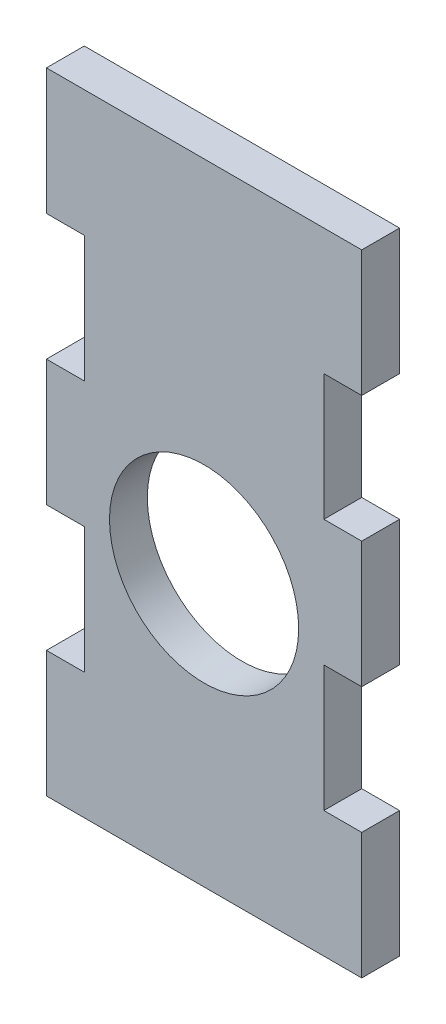
ISO-10303-21;
HEADER;
FILE_DESCRIPTION(('STEP AP214'),'2;1');
FILE_NAME('part.step','',(''),(''),'','','');
FILE_SCHEMA(('AUTOMOTIVE_DESIGN { 1 0 10303 214 1 1 1 1 }'));
ENDSEC;
DATA;
#1=APPLICATION_CONTEXT('core data for automotive mechanical design processes');
#2=APPLICATION_PROTOCOL_DEFINITION('international standard','automotive_design',2000,#1);
#3=PRODUCT_CONTEXT('',#1,'mechanical');
#4=PRODUCT('Part','Part','',(#3));
#5=PRODUCT_RELATED_PRODUCT_CATEGORY('part','',(#4));
#6=PRODUCT_DEFINITION_FORMATION('','',#4);
#7=PRODUCT_DEFINITION_CONTEXT('part definition',#1,'design');
#8=PRODUCT_DEFINITION('design','',#6,#7);
#9=PRODUCT_DEFINITION_SHAPE('','',#8);
#10=(LENGTH_UNIT() NAMED_UNIT(*) SI_UNIT(.MILLI.,.METRE.));
#11=(NAMED_UNIT(*) PLANE_ANGLE_UNIT() SI_UNIT($,.RADIAN.));
#12=(NAMED_UNIT(*) SI_UNIT($,.STERADIAN.) SOLID_ANGLE_UNIT());
#13=UNCERTAINTY_MEASURE_WITH_UNIT(LENGTH_MEASURE(1.E-05),#10,'distance_accuracy_value','');
#14=(GEOMETRIC_REPRESENTATION_CONTEXT(3) GLOBAL_UNCERTAINTY_ASSIGNED_CONTEXT((#13)) GLOBAL_UNIT_ASSIGNED_CONTEXT((#10,
#11,#12)) REPRESENTATION_CONTEXT('',''));
#15=CARTESIAN_POINT('',(0.,0.,0.));
#16=DIRECTION('',(0.,0.,1.));
#17=DIRECTION('',(1.,0.,0.));
#18=AXIS2_PLACEMENT_3D('',#15,#16,#17);
#19=CARTESIAN_POINT('',(-12.5,-25.,3.));
#20=DIRECTION('',(1.,0.,0.));
#21=DIRECTION('',(0.,0.,-1.));
#22=AXIS2_PLACEMENT_3D('',#19,#20,#21);
#23=PLANE('',#22);
#24=DIRECTION('',(0.,-1.,0.));
#25=VECTOR('',#24,1.);
#26=CARTESIAN_POINT('',(-12.5,-25.,0.));
#27=LINE('',#26,#25);
#28=CARTESIAN_POINT('',(-12.5,25.,0.));
#29=VERTEX_POINT('',#28);
#30=CARTESIAN_POINT('',(-12.5,15.,0.));
#31=VERTEX_POINT('',#30);
#32=EDGE_CURVE('E186',#29,#31,#27,.T.);
#33=ORIENTED_EDGE('',*,*,#32,.T.);
#34=DIRECTION('',(0.,0.,1.));
#35=VECTOR('',#34,1.);
#36=CARTESIAN_POINT('',(-12.5,15.,0.));
#37=LINE('',#36,#35);
#38=CARTESIAN_POINT('',(-12.5,15.,3.));
#39=VERTEX_POINT('',#38);
#40=EDGE_CURVE('E170',#31,#39,#37,.T.);
#41=ORIENTED_EDGE('',*,*,#40,.T.);
#42=DIRECTION('',(0.,-1.,0.));
#43=VECTOR('',#42,1.);
#44=CARTESIAN_POINT('',(-12.5,-25.,3.));
#45=LINE('',#44,#43);
#46=CARTESIAN_POINT('',(-12.5,25.,3.));
#47=VERTEX_POINT('',#46);
#48=EDGE_CURVE('E223',#47,#39,#45,.T.);
#49=ORIENTED_EDGE('',*,*,#48,.F.);
#50=DIRECTION('',(0.,0.,-1.));
#51=VECTOR('',#50,1.);
#52=CARTESIAN_POINT('',(-12.5,25.,3.));
#53=LINE('',#52,#51);
#54=EDGE_CURVE('E193',#47,#29,#53,.T.);
#55=ORIENTED_EDGE('',*,*,#54,.T.);
#56=EDGE_LOOP('',(#33,#41,#49,#55));
#57=FACE_BOUND('',#56,.T.);
#58=ADVANCED_FACE('F33',(#57),#23,.F.);
#59=CARTESIAN_POINT('',(-12.5,5.,3.));
#60=VERTEX_POINT('',#59);
#61=CARTESIAN_POINT('',(-12.5,-5.,3.));
#62=VERTEX_POINT('',#61);
#63=EDGE_CURVE('E226',#60,#62,#45,.T.);
#64=ORIENTED_EDGE('',*,*,#63,.F.);
#65=DIRECTION('',(0.,0.,1.));
#66=VECTOR('',#65,1.);
#67=CARTESIAN_POINT('',(-12.5,5.,0.));
#68=LINE('',#67,#66);
#69=CARTESIAN_POINT('',(-12.5,5.,0.));
#70=VERTEX_POINT('',#69);
#71=EDGE_CURVE('E180',#70,#60,#68,.T.);
#72=ORIENTED_EDGE('',*,*,#71,.F.);
#73=CARTESIAN_POINT('',(-12.5,-5.,0.));
#74=VERTEX_POINT('',#73);
#75=EDGE_CURVE('E195',#70,#74,#27,.T.);
#76=ORIENTED_EDGE('',*,*,#75,.T.);
#77=DIRECTION('',(0.,0.,1.));
#78=VECTOR('',#77,1.);
#79=CARTESIAN_POINT('',(-12.5,-5.,0.));
#80=LINE('',#79,#78);
#81=EDGE_CURVE('E298',#74,#62,#80,.T.);
#82=ORIENTED_EDGE('',*,*,#81,.T.);
#83=EDGE_LOOP('',(#64,#72,#76,#82));
#84=FACE_BOUND('',#83,.T.);
#85=ADVANCED_FACE('F373',(#84),#23,.F.);
#86=CARTESIAN_POINT('',(12.5,-25.,3.));
#87=DIRECTION('',(-1.,0.,0.));
#88=DIRECTION('',(0.,0.,1.));
#89=AXIS2_PLACEMENT_3D('',#86,#87,#88);
#90=PLANE('',#89);
#91=DIRECTION('',(0.,1.,0.));
#92=VECTOR('',#91,1.);
#93=CARTESIAN_POINT('',(12.5,-25.,0.));
#94=LINE('',#93,#92);
#95=CARTESIAN_POINT('',(12.5,-25.,0.));
#96=VERTEX_POINT('',#95);
#97=CARTESIAN_POINT('',(12.5,-15.,0.));
#98=VERTEX_POINT('',#97);
#99=EDGE_CURVE('E251',#96,#98,#94,.T.);
#100=ORIENTED_EDGE('',*,*,#99,.T.);
#101=DIRECTION('',(0.,0.,1.));
#102=VECTOR('',#101,1.);
#103=CARTESIAN_POINT('',(12.5,-15.,0.));
#104=LINE('',#103,#102);
#105=CARTESIAN_POINT('',(12.5,-15.,3.));
#106=VERTEX_POINT('',#105);
#107=EDGE_CURVE('E329',#98,#106,#104,.T.);
#108=ORIENTED_EDGE('',*,*,#107,.T.);
#109=DIRECTION('',(0.,1.,0.));
#110=VECTOR('',#109,1.);
#111=CARTESIAN_POINT('',(12.5,-25.,3.));
#112=LINE('',#111,#110);
#113=CARTESIAN_POINT('',(12.5,-25.,3.));
#114=VERTEX_POINT('',#113);
#115=EDGE_CURVE('E230',#114,#106,#112,.T.);
#116=ORIENTED_EDGE('',*,*,#115,.F.);
#117=DIRECTION('',(0.,0.,-1.));
#118=VECTOR('',#117,1.);
#119=CARTESIAN_POINT('',(12.5,-25.,3.));
#120=LINE('',#119,#118);
#121=EDGE_CURVE('E41',#114,#96,#120,.T.);
#122=ORIENTED_EDGE('',*,*,#121,.T.);
#123=EDGE_LOOP('',(#100,#108,#116,#122));
#124=FACE_BOUND('',#123,.T.);
#125=ADVANCED_FACE('F249',(#124),#90,.F.);
#126=CARTESIAN_POINT('',(12.5,-5.,3.));
#127=VERTEX_POINT('',#126);
#128=CARTESIAN_POINT('',(12.5,5.,3.));
#129=VERTEX_POINT('',#128);
#130=EDGE_CURVE('E233',#127,#129,#112,.T.);
#131=ORIENTED_EDGE('',*,*,#130,.F.);
#132=DIRECTION('',(0.,0.,1.));
#133=VECTOR('',#132,1.);
#134=CARTESIAN_POINT('',(12.5,-5.,0.));
#135=LINE('',#134,#133);
#136=CARTESIAN_POINT('',(12.5,-5.,0.));
#137=VERTEX_POINT('',#136);
#138=EDGE_CURVE('E322',#137,#127,#135,.T.);
#139=ORIENTED_EDGE('',*,*,#138,.F.);
#140=CARTESIAN_POINT('',(12.5,5.,0.));
#141=VERTEX_POINT('',#140);
#142=EDGE_CURVE('E258',#137,#141,#94,.T.);
#143=ORIENTED_EDGE('',*,*,#142,.T.);
#144=DIRECTION('',(0.,0.,1.));
#145=VECTOR('',#144,1.);
#146=CARTESIAN_POINT('',(12.5,5.,0.));
#147=LINE('',#146,#145);
#148=EDGE_CURVE('E201',#141,#129,#147,.T.);
#149=ORIENTED_EDGE('',*,*,#148,.T.);
#150=EDGE_LOOP('',(#131,#139,#143,#149));
#151=FACE_BOUND('',#150,.T.);
#152=ADVANCED_FACE('F380',(#151),#90,.F.);
#153=CARTESIAN_POINT('',(-12.5,-15.,3.));
#154=VERTEX_POINT('',#153);
#155=CARTESIAN_POINT('',(-12.5,-25.,3.));
#156=VERTEX_POINT('',#155);
#157=EDGE_CURVE('E227',#154,#156,#45,.T.);
#158=ORIENTED_EDGE('',*,*,#157,.F.);
#159=DIRECTION('',(0.,0.,1.));
#160=VECTOR('',#159,1.);
#161=CARTESIAN_POINT('',(-12.5,-15.,0.));
#162=LINE('',#161,#160);
#163=CARTESIAN_POINT('',(-12.5,-15.,0.));
#164=VERTEX_POINT('',#163);
#165=EDGE_CURVE('E311',#164,#154,#162,.T.);
#166=ORIENTED_EDGE('',*,*,#165,.F.);
#167=CARTESIAN_POINT('',(-12.5,-25.,0.));
#168=VERTEX_POINT('',#167);
#169=EDGE_CURVE('E197',#164,#168,#27,.T.);
#170=ORIENTED_EDGE('',*,*,#169,.T.);
#171=DIRECTION('',(0.,0.,-1.));
#172=VECTOR('',#171,1.);
#173=CARTESIAN_POINT('',(-12.5,-25.,3.));
#174=LINE('',#173,#172);
#175=EDGE_CURVE('E11',#156,#168,#174,.T.);
#176=ORIENTED_EDGE('',*,*,#175,.F.);
#177=EDGE_LOOP('',(#158,#166,#170,#176));
#178=FACE_BOUND('',#177,.T.);
#179=ADVANCED_FACE('F35',(#178),#23,.F.);
#180=CARTESIAN_POINT('',(12.5,-25.,3.));
#181=DIRECTION('',(0.,1.,0.));
#182=DIRECTION('',(-1.,0.,0.));
#183=AXIS2_PLACEMENT_3D('',#180,#181,#182);
#184=PLANE('',#183);
#185=DIRECTION('',(1.,0.,0.));
#186=VECTOR('',#185,1.);
#187=CARTESIAN_POINT('',(12.5,-25.,0.));
#188=LINE('',#187,#186);
#189=EDGE_CURVE('E194',#168,#96,#188,.T.);
#190=ORIENTED_EDGE('',*,*,#189,.T.);
#191=ORIENTED_EDGE('',*,*,#121,.F.);
#192=DIRECTION('',(1.,0.,0.));
#193=VECTOR('',#192,1.);
#194=CARTESIAN_POINT('',(12.5,-25.,3.));
#195=LINE('',#194,#193);
#196=EDGE_CURVE('E225',#156,#114,#195,.T.);
#197=ORIENTED_EDGE('',*,*,#196,.F.);
#198=ORIENTED_EDGE('',*,*,#175,.T.);
#199=EDGE_LOOP('',(#190,#191,#197,#198));
#200=FACE_BOUND('',#199,.T.);
#201=ADVANCED_FACE('F379',(#200),#184,.F.);
#202=CARTESIAN_POINT('',(12.5,15.,3.));
#203=VERTEX_POINT('',#202);
#204=CARTESIAN_POINT('',(12.5,25.,3.));
#205=VERTEX_POINT('',#204);
#206=EDGE_CURVE('E229',#203,#205,#112,.T.);
#207=ORIENTED_EDGE('',*,*,#206,.F.);
#208=DIRECTION('',(0.,0.,1.));
#209=VECTOR('',#208,1.);
#210=CARTESIAN_POINT('',(12.5,15.,0.));
#211=LINE('',#210,#209);
#212=CARTESIAN_POINT('',(12.5,15.,0.));
#213=VERTEX_POINT('',#212);
#214=EDGE_CURVE('E220',#213,#203,#211,.T.);
#215=ORIENTED_EDGE('',*,*,#214,.F.);
#216=CARTESIAN_POINT('',(12.5,25.,0.));
#217=VERTEX_POINT('',#216);
#218=EDGE_CURVE('E198',#213,#217,#94,.T.);
#219=ORIENTED_EDGE('',*,*,#218,.T.);
#220=DIRECTION('',(0.,0.,-1.));
#221=VECTOR('',#220,1.);
#222=CARTESIAN_POINT('',(12.5,25.,3.));
#223=LINE('',#222,#221);
#224=EDGE_CURVE('E236',#205,#217,#223,.T.);
#225=ORIENTED_EDGE('',*,*,#224,.F.);
#226=EDGE_LOOP('',(#207,#215,#219,#225));
#227=FACE_BOUND('',#226,.T.);
#228=ADVANCED_FACE('F264',(#227),#90,.F.);
#229=CARTESIAN_POINT('',(12.5,25.,3.));
#230=DIRECTION('',(0.,-1.,0.));
#231=DIRECTION('',(0.,0.,-1.));
#232=AXIS2_PLACEMENT_3D('',#229,#230,#231);
#233=PLANE('',#232);
#234=DIRECTION('',(-1.,0.,0.));
#235=VECTOR('',#234,1.);
#236=CARTESIAN_POINT('',(12.5,25.,0.));
#237=LINE('',#236,#235);
#238=EDGE_CURVE('E241',#217,#29,#237,.T.);
#239=ORIENTED_EDGE('',*,*,#238,.T.);
#240=ORIENTED_EDGE('',*,*,#54,.F.);
#241=DIRECTION('',(-1.,0.,0.));
#242=VECTOR('',#241,1.);
#243=CARTESIAN_POINT('',(12.5,25.,3.));
#244=LINE('',#243,#242);
#245=EDGE_CURVE('E232',#205,#47,#244,.T.);
#246=ORIENTED_EDGE('',*,*,#245,.F.);
#247=ORIENTED_EDGE('',*,*,#224,.T.);
#248=EDGE_LOOP('',(#239,#240,#246,#247));
#249=FACE_BOUND('',#248,.T.);
#250=ADVANCED_FACE('F267',(#249),#233,.F.);
#251=CARTESIAN_POINT('',(0.,0.,3.));
#252=DIRECTION('',(0.,0.,1.));
#253=DIRECTION('',(1.,0.,0.));
#254=AXIS2_PLACEMENT_3D('',#251,#252,#253);
#255=PLANE('',#254);
#256=CARTESIAN_POINT('',(0.,-3.49999999999998,3.));
#257=DIRECTION('',(0.,0.,1.));
#258=DIRECTION('',(1.,0.,0.));
#259=AXIS2_PLACEMENT_3D('',#256,#257,#258);
#260=CIRCLE('',#259,7.5);
#261=CARTESIAN_POINT('',(7.5,-3.49999999999998,3.));
#262=VERTEX_POINT('',#261);
#263=EDGE_CURVE('E278',#262,#262,#260,.T.);
#264=ORIENTED_EDGE('',*,*,#263,.F.);
#265=EDGE_LOOP('',(#264));
#266=FACE_BOUND('',#265,.T.);
#267=DIRECTION('',(-1.,0.,0.));
#268=VECTOR('',#267,1.);
#269=CARTESIAN_POINT('',(-9.50000000000001,15.,3.));
#270=LINE('',#269,#268);
#271=CARTESIAN_POINT('',(-9.50000000000001,15.,3.));
#272=VERTEX_POINT('',#271);
#273=EDGE_CURVE('E175',#272,#39,#270,.T.);
#274=ORIENTED_EDGE('',*,*,#273,.F.);
#275=DIRECTION('',(0.,1.,0.));
#276=VECTOR('',#275,1.);
#277=CARTESIAN_POINT('',(-9.50000000000001,15.,3.));
#278=LINE('',#277,#276);
#279=CARTESIAN_POINT('',(-9.50000000000001,5.,3.));
#280=VERTEX_POINT('',#279);
#281=EDGE_CURVE('E189',#280,#272,#278,.T.);
#282=ORIENTED_EDGE('',*,*,#281,.F.);
#283=DIRECTION('',(1.,0.,0.));
#284=VECTOR('',#283,1.);
#285=CARTESIAN_POINT('',(-12.5,5.,3.));
#286=LINE('',#285,#284);
#287=EDGE_CURVE('E272',#60,#280,#286,.T.);
#288=ORIENTED_EDGE('',*,*,#287,.F.);
#289=ORIENTED_EDGE('',*,*,#63,.T.);
#290=DIRECTION('',(-1.,0.,0.));
#291=VECTOR('',#290,1.);
#292=CARTESIAN_POINT('',(-12.5,-5.,3.));
#293=LINE('',#292,#291);
#294=CARTESIAN_POINT('',(-9.50000000000002,-5.,3.));
#295=VERTEX_POINT('',#294);
#296=EDGE_CURVE('E286',#295,#62,#293,.T.);
#297=ORIENTED_EDGE('',*,*,#296,.F.);
#298=DIRECTION('',(0.,1.,0.));
#299=VECTOR('',#298,1.);
#300=CARTESIAN_POINT('',(-9.50000000000002,-5.,3.));
#301=LINE('',#300,#299);
#302=CARTESIAN_POINT('',(-9.50000000000002,-15.,3.));
#303=VERTEX_POINT('',#302);
#304=EDGE_CURVE('E294',#303,#295,#301,.T.);
#305=ORIENTED_EDGE('',*,*,#304,.F.);
#306=DIRECTION('',(1.,0.,0.));
#307=VECTOR('',#306,1.);
#308=CARTESIAN_POINT('',(-12.5,-15.,3.));
#309=LINE('',#308,#307);
#310=EDGE_CURVE('E301',#154,#303,#309,.T.);
#311=ORIENTED_EDGE('',*,*,#310,.F.);
#312=ORIENTED_EDGE('',*,*,#157,.T.);
#313=ORIENTED_EDGE('',*,*,#196,.T.);
#314=ORIENTED_EDGE('',*,*,#115,.T.);
#315=DIRECTION('',(1.,0.,0.));
#316=VECTOR('',#315,1.);
#317=CARTESIAN_POINT('',(12.5,-15.,3.));
#318=LINE('',#317,#316);
#319=CARTESIAN_POINT('',(9.50000000000001,-15.,3.));
#320=VERTEX_POINT('',#319);
#321=EDGE_CURVE('E319',#320,#106,#318,.T.);
#322=ORIENTED_EDGE('',*,*,#321,.F.);
#323=DIRECTION('',(0.,-1.,0.));
#324=VECTOR('',#323,1.);
#325=CARTESIAN_POINT('',(9.50000000000001,-5.,3.));
#326=LINE('',#325,#324);
#327=CARTESIAN_POINT('',(9.50000000000001,-5.,3.));
#328=VERTEX_POINT('',#327);
#329=EDGE_CURVE('E325',#328,#320,#326,.T.);
#330=ORIENTED_EDGE('',*,*,#329,.F.);
#331=DIRECTION('',(-1.,0.,0.));
#332=VECTOR('',#331,1.);
#333=CARTESIAN_POINT('',(12.5,-5.,3.));
#334=LINE('',#333,#332);
#335=EDGE_CURVE('E308',#127,#328,#334,.T.);
#336=ORIENTED_EDGE('',*,*,#335,.F.);
#337=ORIENTED_EDGE('',*,*,#130,.T.);
#338=DIRECTION('',(1.,0.,0.));
#339=VECTOR('',#338,1.);
#340=CARTESIAN_POINT('',(12.5,5.,3.));
#341=LINE('',#340,#339);
#342=CARTESIAN_POINT('',(9.50000000000001,5.,3.));
#343=VERTEX_POINT('',#342);
#344=EDGE_CURVE('E216',#343,#129,#341,.T.);
#345=ORIENTED_EDGE('',*,*,#344,.F.);
#346=DIRECTION('',(0.,-1.,0.));
#347=VECTOR('',#346,1.);
#348=CARTESIAN_POINT('',(9.50000000000001,15.,3.));
#349=LINE('',#348,#347);
#350=CARTESIAN_POINT('',(9.50000000000001,15.,3.));
#351=VERTEX_POINT('',#350);
#352=EDGE_CURVE('E345',#351,#343,#349,.T.);
#353=ORIENTED_EDGE('',*,*,#352,.F.);
#354=DIRECTION('',(-1.,0.,0.));
#355=VECTOR('',#354,1.);
#356=CARTESIAN_POINT('',(12.5,15.,3.));
#357=LINE('',#356,#355);
#358=EDGE_CURVE('E331',#203,#351,#357,.T.);
#359=ORIENTED_EDGE('',*,*,#358,.F.);
#360=ORIENTED_EDGE('',*,*,#206,.T.);
#361=ORIENTED_EDGE('',*,*,#245,.T.);
#362=ORIENTED_EDGE('',*,*,#48,.T.);
#363=EDGE_LOOP('',(#274,#282,#288,#289,#297,#305,#311,#312,#313,#314,#322,#330,#336,#337,#345,
#353,#359,#360,#361,#362));
#364=FACE_BOUND('',#363,.T.);
#365=ADVANCED_FACE('F268',(#266,#364),#255,.T.);
#366=CARTESIAN_POINT('',(0.,0.,0.));
#367=DIRECTION('',(0.,0.,1.));
#368=DIRECTION('',(1.,0.,0.));
#369=AXIS2_PLACEMENT_3D('',#366,#367,#368);
#370=PLANE('',#369);
#371=CARTESIAN_POINT('',(0.,-3.49999999999998,0.));
#372=DIRECTION('',(0.,0.,1.));
#373=DIRECTION('',(1.,0.,0.));
#374=AXIS2_PLACEMENT_3D('',#371,#372,#373);
#375=CIRCLE('',#374,7.5);
#376=CARTESIAN_POINT('',(7.5,-3.49999999999998,0.));
#377=VERTEX_POINT('',#376);
#378=EDGE_CURVE('E273',#377,#377,#375,.T.);
#379=ORIENTED_EDGE('',*,*,#378,.T.);
#380=EDGE_LOOP('',(#379));
#381=FACE_BOUND('',#380,.T.);
#382=DIRECTION('',(0.,1.,0.));
#383=VECTOR('',#382,1.);
#384=CARTESIAN_POINT('',(-9.50000000000001,15.,0.));
#385=LINE('',#384,#383);
#386=CARTESIAN_POINT('',(-9.50000000000001,5.,0.));
#387=VERTEX_POINT('',#386);
#388=CARTESIAN_POINT('',(-9.50000000000001,15.,0.));
#389=VERTEX_POINT('',#388);
#390=EDGE_CURVE('E48',#387,#389,#385,.T.);
#391=ORIENTED_EDGE('',*,*,#390,.T.);
#392=DIRECTION('',(-1.,0.,0.));
#393=VECTOR('',#392,1.);
#394=CARTESIAN_POINT('',(-9.50000000000001,15.,0.));
#395=LINE('',#394,#393);
#396=EDGE_CURVE('E173',#389,#31,#395,.T.);
#397=ORIENTED_EDGE('',*,*,#396,.T.);
#398=ORIENTED_EDGE('',*,*,#32,.F.);
#399=ORIENTED_EDGE('',*,*,#238,.F.);
#400=ORIENTED_EDGE('',*,*,#218,.F.);
#401=DIRECTION('',(-1.,0.,0.));
#402=VECTOR('',#401,1.);
#403=CARTESIAN_POINT('',(12.5,15.,0.));
#404=LINE('',#403,#402);
#405=CARTESIAN_POINT('',(9.50000000000001,15.,0.));
#406=VERTEX_POINT('',#405);
#407=EDGE_CURVE('E337',#213,#406,#404,.T.);
#408=ORIENTED_EDGE('',*,*,#407,.T.);
#409=DIRECTION('',(0.,-1.,0.));
#410=VECTOR('',#409,1.);
#411=CARTESIAN_POINT('',(9.50000000000001,15.,0.));
#412=LINE('',#411,#410);
#413=CARTESIAN_POINT('',(9.50000000000001,5.,0.));
#414=VERTEX_POINT('',#413);
#415=EDGE_CURVE('E339',#406,#414,#412,.T.);
#416=ORIENTED_EDGE('',*,*,#415,.T.);
#417=DIRECTION('',(1.,0.,0.));
#418=VECTOR('',#417,1.);
#419=CARTESIAN_POINT('',(12.5,5.,0.));
#420=LINE('',#419,#418);
#421=EDGE_CURVE('E222',#414,#141,#420,.T.);
#422=ORIENTED_EDGE('',*,*,#421,.T.);
#423=ORIENTED_EDGE('',*,*,#142,.F.);
#424=DIRECTION('',(-1.,0.,0.));
#425=VECTOR('',#424,1.);
#426=CARTESIAN_POINT('',(12.5,-5.,0.));
#427=LINE('',#426,#425);
#428=CARTESIAN_POINT('',(9.50000000000001,-5.,0.));
#429=VERTEX_POINT('',#428);
#430=EDGE_CURVE('E315',#137,#429,#427,.T.);
#431=ORIENTED_EDGE('',*,*,#430,.T.);
#432=DIRECTION('',(0.,-1.,0.));
#433=VECTOR('',#432,1.);
#434=CARTESIAN_POINT('',(9.50000000000001,-5.,0.));
#435=LINE('',#434,#433);
#436=CARTESIAN_POINT('',(9.50000000000001,-15.,0.));
#437=VERTEX_POINT('',#436);
#438=EDGE_CURVE('E318',#429,#437,#435,.T.);
#439=ORIENTED_EDGE('',*,*,#438,.T.);
#440=DIRECTION('',(1.,0.,0.));
#441=VECTOR('',#440,1.);
#442=CARTESIAN_POINT('',(12.5,-15.,0.));
#443=LINE('',#442,#441);
#444=EDGE_CURVE('E257',#437,#98,#443,.T.);
#445=ORIENTED_EDGE('',*,*,#444,.T.);
#446=ORIENTED_EDGE('',*,*,#99,.F.);
#447=ORIENTED_EDGE('',*,*,#189,.F.);
#448=ORIENTED_EDGE('',*,*,#169,.F.);
#449=DIRECTION('',(1.,0.,0.));
#450=VECTOR('',#449,1.);
#451=CARTESIAN_POINT('',(-12.5,-15.,0.));
#452=LINE('',#451,#450);
#453=CARTESIAN_POINT('',(-9.50000000000002,-15.,0.));
#454=VERTEX_POINT('',#453);
#455=EDGE_CURVE('E293',#164,#454,#452,.T.);
#456=ORIENTED_EDGE('',*,*,#455,.T.);
#457=DIRECTION('',(0.,1.,0.));
#458=VECTOR('',#457,1.);
#459=CARTESIAN_POINT('',(-9.50000000000002,-5.,0.));
#460=LINE('',#459,#458);
#461=CARTESIAN_POINT('',(-9.50000000000002,-5.,0.));
#462=VERTEX_POINT('',#461);
#463=EDGE_CURVE('E56',#454,#462,#460,.T.);
#464=ORIENTED_EDGE('',*,*,#463,.T.);
#465=DIRECTION('',(-1.,0.,0.));
#466=VECTOR('',#465,1.);
#467=CARTESIAN_POINT('',(-12.5,-5.,0.));
#468=LINE('',#467,#466);
#469=EDGE_CURVE('E290',#462,#74,#468,.T.);
#470=ORIENTED_EDGE('',*,*,#469,.T.);
#471=ORIENTED_EDGE('',*,*,#75,.F.);
#472=DIRECTION('',(1.,0.,0.));
#473=VECTOR('',#472,1.);
#474=CARTESIAN_POINT('',(-12.5,5.,0.));
#475=LINE('',#474,#473);
#476=EDGE_CURVE('E188',#70,#387,#475,.T.);
#477=ORIENTED_EDGE('',*,*,#476,.T.);
#478=EDGE_LOOP('',(#391,#397,#398,#399,#400,#408,#416,#422,#423,#431,#439,#445,#446,#447,#448,
#456,#464,#470,#471,#477));
#479=FACE_BOUND('',#478,.T.);
#480=ADVANCED_FACE('F184',(#381,#479),#370,.F.);
#481=CARTESIAN_POINT('',(12.5,5.,0.));
#482=DIRECTION('',(0.,-1.,0.));
#483=DIRECTION('',(1.,0.,0.));
#484=AXIS2_PLACEMENT_3D('',#481,#482,#483);
#485=PLANE('',#484);
#486=ORIENTED_EDGE('',*,*,#344,.T.);
#487=ORIENTED_EDGE('',*,*,#148,.F.);
#488=ORIENTED_EDGE('',*,*,#421,.F.);
#489=DIRECTION('',(0.,0.,1.));
#490=VECTOR('',#489,1.);
#491=CARTESIAN_POINT('',(9.50000000000001,5.,0.));
#492=LINE('',#491,#490);
#493=EDGE_CURVE('E208',#414,#343,#492,.T.);
#494=ORIENTED_EDGE('',*,*,#493,.T.);
#495=EDGE_LOOP('',(#486,#487,#488,#494));
#496=FACE_BOUND('',#495,.T.);
#497=ADVANCED_FACE('F352',(#496),#485,.F.);
#498=CARTESIAN_POINT('',(9.50000000000001,15.,0.));
#499=DIRECTION('',(-1.,0.,0.));
#500=DIRECTION('',(0.,-1.,0.));
#501=AXIS2_PLACEMENT_3D('',#498,#499,#500);
#502=PLANE('',#501);
#503=ORIENTED_EDGE('',*,*,#352,.T.);
#504=ORIENTED_EDGE('',*,*,#493,.F.);
#505=ORIENTED_EDGE('',*,*,#415,.F.);
#506=DIRECTION('',(0.,0.,1.));
#507=VECTOR('',#506,1.);
#508=CARTESIAN_POINT('',(9.50000000000001,15.,0.));
#509=LINE('',#508,#507);
#510=EDGE_CURVE('E213',#406,#351,#509,.T.);
#511=ORIENTED_EDGE('',*,*,#510,.T.);
#512=EDGE_LOOP('',(#503,#504,#505,#511));
#513=FACE_BOUND('',#512,.T.);
#514=ADVANCED_FACE('F362',(#513),#502,.F.);
#515=CARTESIAN_POINT('',(12.5,15.,0.));
#516=DIRECTION('',(0.,1.,0.));
#517=DIRECTION('',(-1.,0.,0.));
#518=AXIS2_PLACEMENT_3D('',#515,#516,#517);
#519=PLANE('',#518);
#520=ORIENTED_EDGE('',*,*,#358,.T.);
#521=ORIENTED_EDGE('',*,*,#510,.F.);
#522=ORIENTED_EDGE('',*,*,#407,.F.);
#523=ORIENTED_EDGE('',*,*,#214,.T.);
#524=EDGE_LOOP('',(#520,#521,#522,#523));
#525=FACE_BOUND('',#524,.T.);
#526=ADVANCED_FACE('F360',(#525),#519,.F.);
#527=CARTESIAN_POINT('',(12.5,-15.,0.));
#528=DIRECTION('',(0.,-1.,0.));
#529=DIRECTION('',(0.,0.,-1.));
#530=AXIS2_PLACEMENT_3D('',#527,#528,#529);
#531=PLANE('',#530);
#532=ORIENTED_EDGE('',*,*,#321,.T.);
#533=ORIENTED_EDGE('',*,*,#107,.F.);
#534=ORIENTED_EDGE('',*,*,#444,.F.);
#535=DIRECTION('',(0.,0.,1.));
#536=VECTOR('',#535,1.);
#537=CARTESIAN_POINT('',(9.50000000000001,-15.,0.));
#538=LINE('',#537,#536);
#539=EDGE_CURVE('E332',#437,#320,#538,.T.);
#540=ORIENTED_EDGE('',*,*,#539,.T.);
#541=EDGE_LOOP('',(#532,#533,#534,#540));
#542=FACE_BOUND('',#541,.T.);
#543=ADVANCED_FACE('F369',(#542),#531,.F.);
#544=CARTESIAN_POINT('',(9.50000000000001,-5.,0.));
#545=DIRECTION('',(-1.,0.,0.));
#546=DIRECTION('',(0.,0.,1.));
#547=AXIS2_PLACEMENT_3D('',#544,#545,#546);
#548=PLANE('',#547);
#549=ORIENTED_EDGE('',*,*,#329,.T.);
#550=ORIENTED_EDGE('',*,*,#539,.F.);
#551=ORIENTED_EDGE('',*,*,#438,.F.);
#552=DIRECTION('',(0.,0.,1.));
#553=VECTOR('',#552,1.);
#554=CARTESIAN_POINT('',(9.50000000000001,-5.,0.));
#555=LINE('',#554,#553);
#556=EDGE_CURVE('E334',#429,#328,#555,.T.);
#557=ORIENTED_EDGE('',*,*,#556,.T.);
#558=EDGE_LOOP('',(#549,#550,#551,#557));
#559=FACE_BOUND('',#558,.T.);
#560=ADVANCED_FACE('F414',(#559),#548,.F.);
#561=CARTESIAN_POINT('',(12.5,-5.,0.));
#562=DIRECTION('',(0.,1.,0.));
#563=DIRECTION('',(0.,0.,1.));
#564=AXIS2_PLACEMENT_3D('',#561,#562,#563);
#565=PLANE('',#564);
#566=ORIENTED_EDGE('',*,*,#335,.T.);
#567=ORIENTED_EDGE('',*,*,#556,.F.);
#568=ORIENTED_EDGE('',*,*,#430,.F.);
#569=ORIENTED_EDGE('',*,*,#138,.T.);
#570=EDGE_LOOP('',(#566,#567,#568,#569));
#571=FACE_BOUND('',#570,.T.);
#572=ADVANCED_FACE('F407',(#571),#565,.F.);
#573=CARTESIAN_POINT('',(-12.5,-5.,0.));
#574=DIRECTION('',(0.,1.,0.));
#575=DIRECTION('',(0.,0.,1.));
#576=AXIS2_PLACEMENT_3D('',#573,#574,#575);
#577=PLANE('',#576);
#578=ORIENTED_EDGE('',*,*,#296,.T.);
#579=ORIENTED_EDGE('',*,*,#81,.F.);
#580=ORIENTED_EDGE('',*,*,#469,.F.);
#581=DIRECTION('',(0.,0.,1.));
#582=VECTOR('',#581,1.);
#583=CARTESIAN_POINT('',(-9.50000000000002,-5.,0.));
#584=LINE('',#583,#582);
#585=EDGE_CURVE('E306',#462,#295,#584,.T.);
#586=ORIENTED_EDGE('',*,*,#585,.T.);
#587=EDGE_LOOP('',(#578,#579,#580,#586));
#588=FACE_BOUND('',#587,.T.);
#589=ADVANCED_FACE('F394',(#588),#577,.F.);
#590=CARTESIAN_POINT('',(-9.50000000000002,-5.,0.));
#591=DIRECTION('',(1.,0.,0.));
#592=DIRECTION('',(0.,0.,-1.));
#593=AXIS2_PLACEMENT_3D('',#590,#591,#592);
#594=PLANE('',#593);
#595=ORIENTED_EDGE('',*,*,#304,.T.);
#596=ORIENTED_EDGE('',*,*,#585,.F.);
#597=ORIENTED_EDGE('',*,*,#463,.F.);
#598=DIRECTION('',(0.,0.,1.));
#599=VECTOR('',#598,1.);
#600=CARTESIAN_POINT('',(-9.50000000000002,-15.,0.));
#601=LINE('',#600,#599);
#602=EDGE_CURVE('E309',#454,#303,#601,.T.);
#603=ORIENTED_EDGE('',*,*,#602,.T.);
#604=EDGE_LOOP('',(#595,#596,#597,#603));
#605=FACE_BOUND('',#604,.T.);
#606=ADVANCED_FACE('F399',(#605),#594,.F.);
#607=CARTESIAN_POINT('',(-12.5,-15.,0.));
#608=DIRECTION('',(0.,-1.,0.));
#609=DIRECTION('',(0.,0.,-1.));
#610=AXIS2_PLACEMENT_3D('',#607,#608,#609);
#611=PLANE('',#610);
#612=ORIENTED_EDGE('',*,*,#310,.T.);
#613=ORIENTED_EDGE('',*,*,#602,.F.);
#614=ORIENTED_EDGE('',*,*,#455,.F.);
#615=ORIENTED_EDGE('',*,*,#165,.T.);
#616=EDGE_LOOP('',(#612,#613,#614,#615));
#617=FACE_BOUND('',#616,.T.);
#618=ADVANCED_FACE('F398',(#617),#611,.F.);
#619=CARTESIAN_POINT('',(-9.50000000000001,15.,0.));
#620=DIRECTION('',(0.,1.,0.));
#621=DIRECTION('',(-1.,0.,0.));
#622=AXIS2_PLACEMENT_3D('',#619,#620,#621);
#623=PLANE('',#622);
#624=ORIENTED_EDGE('',*,*,#273,.T.);
#625=ORIENTED_EDGE('',*,*,#40,.F.);
#626=ORIENTED_EDGE('',*,*,#396,.F.);
#627=DIRECTION('',(0.,0.,1.));
#628=VECTOR('',#627,1.);
#629=CARTESIAN_POINT('',(-9.50000000000001,15.,0.));
#630=LINE('',#629,#628);
#631=EDGE_CURVE('E284',#389,#272,#630,.T.);
#632=ORIENTED_EDGE('',*,*,#631,.T.);
#633=EDGE_LOOP('',(#624,#625,#626,#632));
#634=FACE_BOUND('',#633,.T.);
#635=ADVANCED_FACE('F172',(#634),#623,.F.);
#636=CARTESIAN_POINT('',(-9.50000000000001,15.,0.));
#637=DIRECTION('',(1.,0.,0.));
#638=DIRECTION('',(0.,1.,0.));
#639=AXIS2_PLACEMENT_3D('',#636,#637,#638);
#640=PLANE('',#639);
#641=ORIENTED_EDGE('',*,*,#281,.T.);
#642=ORIENTED_EDGE('',*,*,#631,.F.);
#643=ORIENTED_EDGE('',*,*,#390,.F.);
#644=DIRECTION('',(0.,0.,1.));
#645=VECTOR('',#644,1.);
#646=CARTESIAN_POINT('',(-9.50000000000001,5.,0.));
#647=LINE('',#646,#645);
#648=EDGE_CURVE('E287',#387,#280,#647,.T.);
#649=ORIENTED_EDGE('',*,*,#648,.T.);
#650=EDGE_LOOP('',(#641,#642,#643,#649));
#651=FACE_BOUND('',#650,.T.);
#652=ADVANCED_FACE('F450',(#651),#640,.F.);
#653=CARTESIAN_POINT('',(-12.5,5.,0.));
#654=DIRECTION('',(0.,-1.,0.));
#655=DIRECTION('',(1.,0.,0.));
#656=AXIS2_PLACEMENT_3D('',#653,#654,#655);
#657=PLANE('',#656);
#658=ORIENTED_EDGE('',*,*,#287,.T.);
#659=ORIENTED_EDGE('',*,*,#648,.F.);
#660=ORIENTED_EDGE('',*,*,#476,.F.);
#661=ORIENTED_EDGE('',*,*,#71,.T.);
#662=EDGE_LOOP('',(#658,#659,#660,#661));
#663=FACE_BOUND('',#662,.T.);
#664=ADVANCED_FACE('F458',(#663),#657,.F.);
#665=CARTESIAN_POINT('',(0.,-3.49999999999998,0.));
#666=DIRECTION('',(0.,0.,1.));
#667=DIRECTION('',(1.,0.,0.));
#668=AXIS2_PLACEMENT_3D('',#665,#666,#667);
#669=CYLINDRICAL_SURFACE('',#668,7.5);
#670=ORIENTED_EDGE('',*,*,#378,.F.);
#671=EDGE_LOOP('',(#670));
#672=FACE_BOUND('',#671,.T.);
#673=ORIENTED_EDGE('',*,*,#263,.T.);
#674=EDGE_LOOP('',(#673));
#675=FACE_BOUND('',#674,.T.);
#676=ADVANCED_FACE('F467',(#672,#675),#669,.F.);
#677=CLOSED_SHELL('',(#58,#85,#125,#152,#179,#201,#228,#250,#365,#480,#497,#514,#526,#543,#560,
#572,#589,#606,#618,#635,#652,#664,#676));
#678=MANIFOLD_SOLID_BREP('B2',#677);
#679=ADVANCED_BREP_SHAPE_REPRESENTATION('',(#18,#678),#14);
#680=SHAPE_DEFINITION_REPRESENTATION(#9,#679);
ENDSEC;
END-ISO-10303-21;
